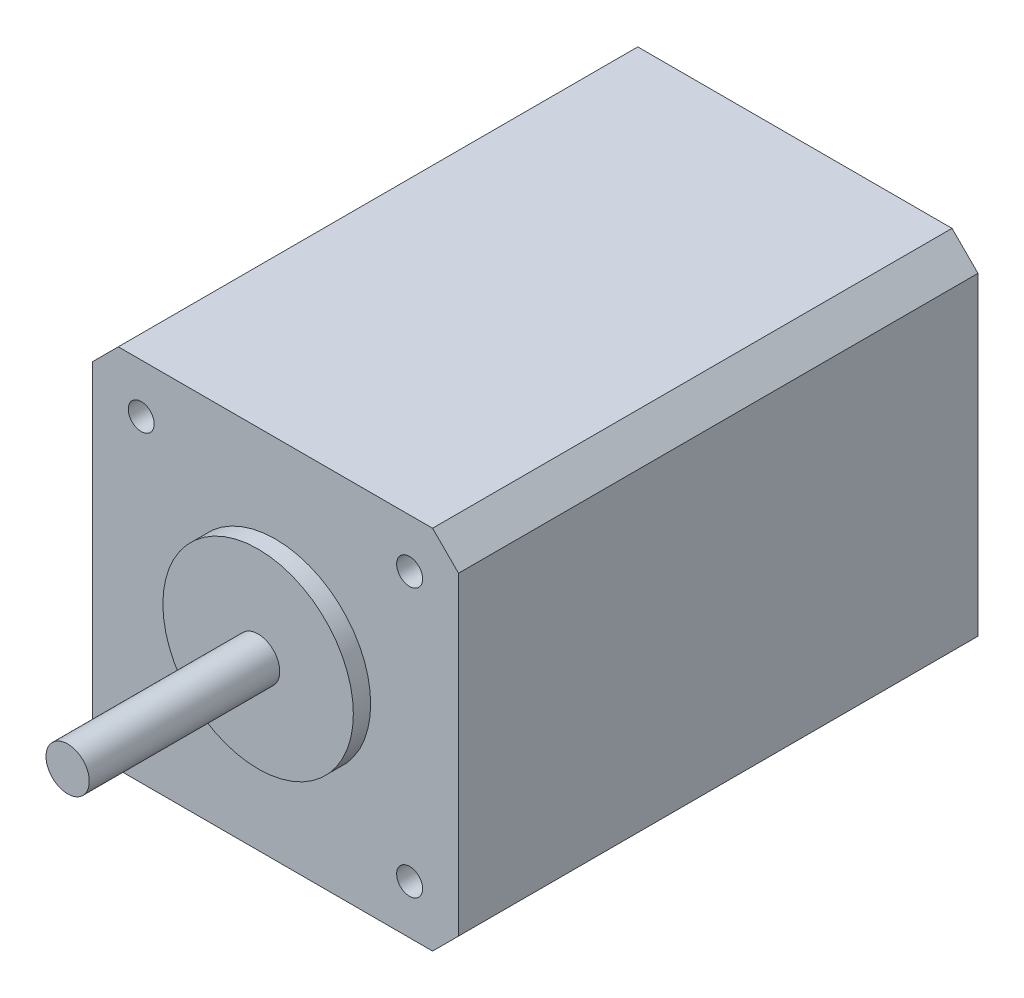
ISO-10303-21;
HEADER;
FILE_DESCRIPTION(('STEP AP214'),'2;1');
FILE_NAME('part.step','',(''),(''),'','','');
FILE_SCHEMA(('AUTOMOTIVE_DESIGN { 1 0 10303 214 1 1 1 1 }'));
ENDSEC;
DATA;
#1=APPLICATION_CONTEXT('core data for automotive mechanical design processes');
#2=APPLICATION_PROTOCOL_DEFINITION('international standard','automotive_design',2000,#1);
#3=PRODUCT_CONTEXT('',#1,'mechanical');
#4=PRODUCT('Part','Part','',(#3));
#5=PRODUCT_RELATED_PRODUCT_CATEGORY('part','',(#4));
#6=PRODUCT_DEFINITION_FORMATION('','',#4);
#7=PRODUCT_DEFINITION_CONTEXT('part definition',#1,'design');
#8=PRODUCT_DEFINITION('design','',#6,#7);
#9=PRODUCT_DEFINITION_SHAPE('','',#8);
#10=(LENGTH_UNIT() NAMED_UNIT(*) SI_UNIT(.MILLI.,.METRE.));
#11=(NAMED_UNIT(*) PLANE_ANGLE_UNIT() SI_UNIT($,.RADIAN.));
#12=(NAMED_UNIT(*) SI_UNIT($,.STERADIAN.) SOLID_ANGLE_UNIT());
#13=UNCERTAINTY_MEASURE_WITH_UNIT(LENGTH_MEASURE(1.E-05),#10,'distance_accuracy_value','');
#14=(GEOMETRIC_REPRESENTATION_CONTEXT(3) GLOBAL_UNCERTAINTY_ASSIGNED_CONTEXT((#13)) GLOBAL_UNIT_ASSIGNED_CONTEXT((#10,
#11,#12)) REPRESENTATION_CONTEXT('',''));
#15=CARTESIAN_POINT('',(0.,0.,0.));
#16=DIRECTION('',(0.,0.,1.));
#17=DIRECTION('',(1.,0.,0.));
#18=AXIS2_PLACEMENT_3D('',#15,#16,#17);
#19=CARTESIAN_POINT('',(21.15,21.15,-5.));
#20=DIRECTION('',(1.,0.,0.));
#21=DIRECTION('',(0.,1.,0.));
#22=AXIS2_PLACEMENT_3D('',#19,#20,#21);
#23=PLANE('',#22);
#24=DIRECTION('',(0.,-1.,0.));
#25=VECTOR('',#24,1.);
#26=CARTESIAN_POINT('',(21.15,21.15,-5.));
#27=LINE('',#26,#25);
#28=CARTESIAN_POINT('',(21.15,18.15,-5.));
#29=VERTEX_POINT('',#28);
#30=CARTESIAN_POINT('',(21.15,-18.15,-5.));
#31=VERTEX_POINT('',#30);
#32=EDGE_CURVE('E103',#29,#31,#27,.T.);
#33=ORIENTED_EDGE('',*,*,#32,.F.);
#34=DIRECTION('',(0.,0.,1.));
#35=VECTOR('',#34,1.);
#36=CARTESIAN_POINT('',(21.15,18.15,55.));
#37=LINE('',#36,#35);
#38=CARTESIAN_POINT('',(21.15,18.15,55.));
#39=VERTEX_POINT('',#38);
#40=EDGE_CURVE('E115',#29,#39,#37,.T.);
#41=ORIENTED_EDGE('',*,*,#40,.T.);
#42=DIRECTION('',(0.,-1.,0.));
#43=VECTOR('',#42,1.);
#44=CARTESIAN_POINT('',(21.15,21.15,55.));
#45=LINE('',#44,#43);
#46=CARTESIAN_POINT('',(21.15,-18.15,55.));
#47=VERTEX_POINT('',#46);
#48=EDGE_CURVE('E173',#39,#47,#45,.T.);
#49=ORIENTED_EDGE('',*,*,#48,.T.);
#50=DIRECTION('',(0.,0.,-1.));
#51=VECTOR('',#50,1.);
#52=CARTESIAN_POINT('',(21.15,-18.15,-5.));
#53=LINE('',#52,#51);
#54=EDGE_CURVE('E118',#47,#31,#53,.T.);
#55=ORIENTED_EDGE('',*,*,#54,.T.);
#56=EDGE_LOOP('',(#33,#41,#49,#55));
#57=FACE_BOUND('',#56,.T.);
#58=ADVANCED_FACE('F33',(#57),#23,.T.);
#59=CARTESIAN_POINT('',(-21.15,21.15,-5.));
#60=DIRECTION('',(0.,0.,-1.));
#61=DIRECTION('',(-1.,0.,0.));
#62=AXIS2_PLACEMENT_3D('',#59,#60,#61);
#63=PLANE('',#62);
#64=DIRECTION('',(1.,0.,0.));
#65=VECTOR('',#64,1.);
#66=CARTESIAN_POINT('',(-21.15,21.15,-5.));
#67=LINE('',#66,#65);
#68=CARTESIAN_POINT('',(-18.15,21.15,-5.));
#69=VERTEX_POINT('',#68);
#70=CARTESIAN_POINT('',(18.1499999999999,21.15,-5.));
#71=VERTEX_POINT('',#70);
#72=EDGE_CURVE('E106',#69,#71,#67,.T.);
#73=ORIENTED_EDGE('',*,*,#72,.T.);
#74=DIRECTION('',(0.707106781186549,-0.707106781186546,0.));
#75=VECTOR('',#74,1.);
#76=CARTESIAN_POINT('',(-1.50000000000011,40.8,-5.));
#77=LINE('',#76,#75);
#78=EDGE_CURVE('E100',#71,#29,#77,.T.);
#79=ORIENTED_EDGE('',*,*,#78,.T.);
#80=ORIENTED_EDGE('',*,*,#32,.T.);
#81=DIRECTION('',(0.707106781186545,0.70710678118655,0.));
#82=VECTOR('',#81,1.);
#83=CARTESIAN_POINT('',(19.6500000000001,-19.6499999999999,-5.));
#84=LINE('',#83,#82);
#85=CARTESIAN_POINT('',(18.15,-21.15,-5.));
#86=VERTEX_POINT('',#85);
#87=EDGE_CURVE('E139',#31,#86,#84,.F.);
#88=ORIENTED_EDGE('',*,*,#87,.T.);
#89=DIRECTION('',(1.,0.,0.));
#90=VECTOR('',#89,1.);
#91=CARTESIAN_POINT('',(-21.15,-21.15,-5.));
#92=LINE('',#91,#90);
#93=CARTESIAN_POINT('',(-18.15,-21.15,-5.));
#94=VERTEX_POINT('',#93);
#95=EDGE_CURVE('E154',#94,#86,#92,.T.);
#96=ORIENTED_EDGE('',*,*,#95,.F.);
#97=DIRECTION('',(0.707106781186546,-0.707106781186549,0.));
#98=VECTOR('',#97,1.);
#99=CARTESIAN_POINT('',(-40.8,1.50000000000009,-5.));
#100=LINE('',#99,#98);
#101=CARTESIAN_POINT('',(-21.15,-18.15,-5.));
#102=VERTEX_POINT('',#101);
#103=EDGE_CURVE('E48',#94,#102,#100,.F.);
#104=ORIENTED_EDGE('',*,*,#103,.T.);
#105=DIRECTION('',(0.,-1.,0.));
#106=VECTOR('',#105,1.);
#107=CARTESIAN_POINT('',(-21.15,21.15,-5.));
#108=LINE('',#107,#106);
#109=CARTESIAN_POINT('',(-21.15,18.15,-5.));
#110=VERTEX_POINT('',#109);
#111=EDGE_CURVE('E120',#110,#102,#108,.T.);
#112=ORIENTED_EDGE('',*,*,#111,.F.);
#113=DIRECTION('',(0.707106781186551,0.707106781186544,0.));
#114=VECTOR('',#113,1.);
#115=CARTESIAN_POINT('',(-19.65,19.65,-5.));
#116=LINE('',#115,#114);
#117=EDGE_CURVE('E56',#110,#69,#116,.T.);
#118=ORIENTED_EDGE('',*,*,#117,.T.);
#119=EDGE_LOOP('',(#73,#79,#80,#88,#96,#104,#112,#118));
#120=FACE_BOUND('',#119,.T.);
#121=ADVANCED_FACE('F102',(#120),#63,.T.);
#122=CARTESIAN_POINT('',(-21.15,21.15,55.));
#123=DIRECTION('',(-1.,0.,0.));
#124=DIRECTION('',(0.,-1.,0.));
#125=AXIS2_PLACEMENT_3D('',#122,#123,#124);
#126=PLANE('',#125);
#127=DIRECTION('',(0.,-1.,0.));
#128=VECTOR('',#127,1.);
#129=CARTESIAN_POINT('',(-21.15,21.15,55.));
#130=LINE('',#129,#128);
#131=CARTESIAN_POINT('',(-21.15,18.15,55.));
#132=VERTEX_POINT('',#131);
#133=CARTESIAN_POINT('',(-21.15,-18.15,55.));
#134=VERTEX_POINT('',#133);
#135=EDGE_CURVE('E171',#132,#134,#130,.T.);
#136=ORIENTED_EDGE('',*,*,#135,.F.);
#137=DIRECTION('',(0.,0.,-1.));
#138=VECTOR('',#137,1.);
#139=CARTESIAN_POINT('',(-21.15,18.15,-5.));
#140=LINE('',#139,#138);
#141=EDGE_CURVE('E144',#132,#110,#140,.T.);
#142=ORIENTED_EDGE('',*,*,#141,.T.);
#143=ORIENTED_EDGE('',*,*,#111,.T.);
#144=DIRECTION('',(0.,0.,1.));
#145=VECTOR('',#144,1.);
#146=CARTESIAN_POINT('',(-21.15,-18.15,55.));
#147=LINE('',#146,#145);
#148=EDGE_CURVE('E110',#102,#134,#147,.T.);
#149=ORIENTED_EDGE('',*,*,#148,.T.);
#150=EDGE_LOOP('',(#136,#142,#143,#149));
#151=FACE_BOUND('',#150,.T.);
#152=ADVANCED_FACE('F181',(#151),#126,.T.);
#153=CARTESIAN_POINT('',(21.15,21.15,55.));
#154=DIRECTION('',(0.,0.,1.));
#155=DIRECTION('',(1.,0.,0.));
#156=AXIS2_PLACEMENT_3D('',#153,#154,#155);
#157=PLANE('',#156);
#158=CARTESIAN_POINT('',(15.5,-15.5,55.));
#159=DIRECTION('',(0.,0.,1.));
#160=DIRECTION('',(1.,0.,0.));
#161=AXIS2_PLACEMENT_3D('',#158,#159,#160);
#162=CIRCLE('',#161,1.49999999999999);
#163=CARTESIAN_POINT('',(17.,-15.5,55.));
#164=VERTEX_POINT('',#163);
#165=EDGE_CURVE('E244',#164,#164,#162,.T.);
#166=ORIENTED_EDGE('',*,*,#165,.F.);
#167=EDGE_LOOP('',(#166));
#168=FACE_BOUND('',#167,.T.);
#169=CARTESIAN_POINT('',(-15.5,-15.5,55.));
#170=DIRECTION('',(0.,0.,1.));
#171=DIRECTION('',(1.,0.,0.));
#172=AXIS2_PLACEMENT_3D('',#169,#170,#171);
#173=CIRCLE('',#172,1.49999999999999);
#174=CARTESIAN_POINT('',(-14.,-15.5,55.));
#175=VERTEX_POINT('',#174);
#176=EDGE_CURVE('E238',#175,#175,#173,.T.);
#177=ORIENTED_EDGE('',*,*,#176,.F.);
#178=EDGE_LOOP('',(#177));
#179=FACE_BOUND('',#178,.T.);
#180=CARTESIAN_POINT('',(-15.5,15.5,55.));
#181=DIRECTION('',(0.,0.,1.));
#182=DIRECTION('',(1.,0.,0.));
#183=AXIS2_PLACEMENT_3D('',#180,#181,#182);
#184=CIRCLE('',#183,1.49999999999999);
#185=CARTESIAN_POINT('',(-14.,15.5,55.));
#186=VERTEX_POINT('',#185);
#187=EDGE_CURVE('E232',#186,#186,#184,.T.);
#188=ORIENTED_EDGE('',*,*,#187,.F.);
#189=EDGE_LOOP('',(#188));
#190=FACE_BOUND('',#189,.T.);
#191=CARTESIAN_POINT('',(15.5,15.5,55.));
#192=DIRECTION('',(0.,0.,1.));
#193=DIRECTION('',(1.,0.,0.));
#194=AXIS2_PLACEMENT_3D('',#191,#192,#193);
#195=CIRCLE('',#194,1.49999999999999);
#196=CARTESIAN_POINT('',(17.,15.5,55.));
#197=VERTEX_POINT('',#196);
#198=EDGE_CURVE('E226',#197,#197,#195,.T.);
#199=ORIENTED_EDGE('',*,*,#198,.F.);
#200=EDGE_LOOP('',(#199));
#201=FACE_BOUND('',#200,.T.);
#202=CARTESIAN_POINT('',(0.,0.,55.));
#203=DIRECTION('',(0.,0.,1.));
#204=DIRECTION('',(1.,0.,0.));
#205=AXIS2_PLACEMENT_3D('',#202,#203,#204);
#206=CIRCLE('',#205,11.);
#207=CARTESIAN_POINT('',(11.,0.,55.));
#208=VERTEX_POINT('',#207);
#209=EDGE_CURVE('E119',#208,#208,#206,.T.);
#210=ORIENTED_EDGE('',*,*,#209,.F.);
#211=EDGE_LOOP('',(#210));
#212=FACE_BOUND('',#211,.T.);
#213=ORIENTED_EDGE('',*,*,#48,.F.);
#214=DIRECTION('',(-0.707106781186549,0.707106781186546,0.));
#215=VECTOR('',#214,1.);
#216=CARTESIAN_POINT('',(19.65,19.65,55.));
#217=LINE('',#216,#215);
#218=CARTESIAN_POINT('',(18.15,21.15,55.));
#219=VERTEX_POINT('',#218);
#220=EDGE_CURVE('E123',#39,#219,#217,.T.);
#221=ORIENTED_EDGE('',*,*,#220,.T.);
#222=DIRECTION('',(-1.,0.,0.));
#223=VECTOR('',#222,1.);
#224=CARTESIAN_POINT('',(21.15,21.15,55.));
#225=LINE('',#224,#223);
#226=CARTESIAN_POINT('',(-18.15,21.15,55.));
#227=VERTEX_POINT('',#226);
#228=EDGE_CURVE('E162',#219,#227,#225,.T.);
#229=ORIENTED_EDGE('',*,*,#228,.T.);
#230=DIRECTION('',(-0.707106781186551,-0.707106781186544,0.));
#231=VECTOR('',#230,1.);
#232=CARTESIAN_POINT('',(1.50000000000019,40.8,55.));
#233=LINE('',#232,#231);
#234=EDGE_CURVE('E132',#227,#132,#233,.T.);
#235=ORIENTED_EDGE('',*,*,#234,.T.);
#236=ORIENTED_EDGE('',*,*,#135,.T.);
#237=DIRECTION('',(-0.707106781186546,0.707106781186549,0.));
#238=VECTOR('',#237,1.);
#239=CARTESIAN_POINT('',(-19.6500000000001,-19.6499999999999,55.));
#240=LINE('',#239,#238);
#241=CARTESIAN_POINT('',(-18.15,-21.15,55.));
#242=VERTEX_POINT('',#241);
#243=EDGE_CURVE('E126',#134,#242,#240,.F.);
#244=ORIENTED_EDGE('',*,*,#243,.T.);
#245=DIRECTION('',(-1.,0.,0.));
#246=VECTOR('',#245,1.);
#247=CARTESIAN_POINT('',(21.15,-21.15,55.));
#248=LINE('',#247,#246);
#249=CARTESIAN_POINT('',(18.15,-21.15,55.));
#250=VERTEX_POINT('',#249);
#251=EDGE_CURVE('E152',#250,#242,#248,.T.);
#252=ORIENTED_EDGE('',*,*,#251,.F.);
#253=DIRECTION('',(-0.707106781186545,-0.70710678118655,0.));
#254=VECTOR('',#253,1.);
#255=CARTESIAN_POINT('',(40.8,1.50000000000014,55.));
#256=LINE('',#255,#254);
#257=EDGE_CURVE('E124',#250,#47,#256,.F.);
#258=ORIENTED_EDGE('',*,*,#257,.T.);
#259=EDGE_LOOP('',(#213,#221,#229,#235,#236,#244,#252,#258));
#260=FACE_BOUND('',#259,.T.);
#261=ADVANCED_FACE('F157',(#168,#179,#190,#201,#212,#260),#157,.T.);
#262=CARTESIAN_POINT('',(0.,21.15,0.));
#263=DIRECTION('',(0.,-1.,0.));
#264=DIRECTION('',(1.,0.,0.));
#265=AXIS2_PLACEMENT_3D('',#262,#263,#264);
#266=PLANE('',#265);
#267=ORIENTED_EDGE('',*,*,#228,.F.);
#268=DIRECTION('',(0.,0.,-1.));
#269=VECTOR('',#268,1.);
#270=CARTESIAN_POINT('',(18.15,21.15,-5.));
#271=LINE('',#270,#269);
#272=EDGE_CURVE('E137',#219,#71,#271,.T.);
#273=ORIENTED_EDGE('',*,*,#272,.T.);
#274=ORIENTED_EDGE('',*,*,#72,.F.);
#275=DIRECTION('',(0.,0.,1.));
#276=VECTOR('',#275,1.);
#277=CARTESIAN_POINT('',(-18.15,21.15,55.));
#278=LINE('',#277,#276);
#279=EDGE_CURVE('E135',#69,#227,#278,.T.);
#280=ORIENTED_EDGE('',*,*,#279,.T.);
#281=EDGE_LOOP('',(#267,#273,#274,#280));
#282=FACE_BOUND('',#281,.T.);
#283=ADVANCED_FACE('F180',(#282),#266,.F.);
#284=CARTESIAN_POINT('',(0.,-21.15,0.));
#285=DIRECTION('',(0.,-1.,0.));
#286=DIRECTION('',(1.,0.,0.));
#287=AXIS2_PLACEMENT_3D('',#284,#285,#286);
#288=PLANE('',#287);
#289=ORIENTED_EDGE('',*,*,#251,.T.);
#290=DIRECTION('',(0.,0.,-1.));
#291=VECTOR('',#290,1.);
#292=CARTESIAN_POINT('',(-18.15,-21.15,0.));
#293=LINE('',#292,#291);
#294=EDGE_CURVE('E11',#242,#94,#293,.T.);
#295=ORIENTED_EDGE('',*,*,#294,.T.);
#296=ORIENTED_EDGE('',*,*,#95,.T.);
#297=DIRECTION('',(0.,0.,1.));
#298=VECTOR('',#297,1.);
#299=CARTESIAN_POINT('',(18.15,-21.15,0.));
#300=LINE('',#299,#298);
#301=EDGE_CURVE('E41',#86,#250,#300,.T.);
#302=ORIENTED_EDGE('',*,*,#301,.T.);
#303=EDGE_LOOP('',(#289,#295,#296,#302));
#304=FACE_BOUND('',#303,.T.);
#305=ADVANCED_FACE('F151',(#304),#288,.T.);
#306=CARTESIAN_POINT('',(0.,0.,79.));
#307=DIRECTION('',(0.,0.,-1.));
#308=DIRECTION('',(-1.,0.,0.));
#309=AXIS2_PLACEMENT_3D('',#306,#307,#308);
#310=CYLINDRICAL_SURFACE('',#309,2.5);
#311=CARTESIAN_POINT('',(0.,0.,79.));
#312=DIRECTION('',(0.,0.,-1.));
#313=DIRECTION('',(-1.,0.,0.));
#314=AXIS2_PLACEMENT_3D('',#311,#312,#313);
#315=CIRCLE('',#314,2.5);
#316=CARTESIAN_POINT('',(-2.5,0.,79.));
#317=VERTEX_POINT('',#316);
#318=EDGE_CURVE('E160',#317,#317,#315,.T.);
#319=ORIENTED_EDGE('',*,*,#318,.T.);
#320=EDGE_LOOP('',(#319));
#321=FACE_BOUND('',#320,.T.);
#322=CARTESIAN_POINT('',(0.,0.,57.));
#323=DIRECTION('',(0.,0.,-1.));
#324=DIRECTION('',(-1.,0.,0.));
#325=AXIS2_PLACEMENT_3D('',#322,#323,#324);
#326=CIRCLE('',#325,2.5);
#327=CARTESIAN_POINT('',(-2.5,0.,57.));
#328=VERTEX_POINT('',#327);
#329=EDGE_CURVE('E220',#328,#328,#326,.T.);
#330=ORIENTED_EDGE('',*,*,#329,.F.);
#331=EDGE_LOOP('',(#330));
#332=FACE_BOUND('',#331,.T.);
#333=ADVANCED_FACE('F292',(#321,#332),#310,.T.);
#334=CARTESIAN_POINT('',(2.5,0.,79.));
#335=DIRECTION('',(0.,0.,1.));
#336=DIRECTION('',(1.,0.,0.));
#337=AXIS2_PLACEMENT_3D('',#334,#335,#336);
#338=PLANE('',#337);
#339=ORIENTED_EDGE('',*,*,#318,.F.);
#340=EDGE_LOOP('',(#339));
#341=FACE_BOUND('',#340,.T.);
#342=ADVANCED_FACE('F288',(#341),#338,.T.);
#343=CARTESIAN_POINT('',(0.,0.,79.));
#344=DIRECTION('',(0.,0.,-1.));
#345=DIRECTION('',(-1.,0.,0.));
#346=AXIS2_PLACEMENT_3D('',#343,#344,#345);
#347=CYLINDRICAL_SURFACE('',#346,11.);
#348=CARTESIAN_POINT('',(0.,0.,57.));
#349=DIRECTION('',(0.,0.,-1.));
#350=DIRECTION('',(-1.,0.,0.));
#351=AXIS2_PLACEMENT_3D('',#348,#349,#350);
#352=CIRCLE('',#351,11.);
#353=CARTESIAN_POINT('',(-11.,0.,57.));
#354=VERTEX_POINT('',#353);
#355=EDGE_CURVE('E165',#354,#354,#352,.T.);
#356=ORIENTED_EDGE('',*,*,#355,.T.);
#357=EDGE_LOOP('',(#356));
#358=FACE_BOUND('',#357,.T.);
#359=ORIENTED_EDGE('',*,*,#209,.T.);
#360=EDGE_LOOP('',(#359));
#361=FACE_BOUND('',#360,.T.);
#362=ADVANCED_FACE('F177',(#358,#361),#347,.T.);
#363=CARTESIAN_POINT('',(11.,0.,57.));
#364=DIRECTION('',(0.,0.,1.));
#365=DIRECTION('',(1.,0.,0.));
#366=AXIS2_PLACEMENT_3D('',#363,#364,#365);
#367=PLANE('',#366);
#368=ORIENTED_EDGE('',*,*,#329,.T.);
#369=EDGE_LOOP('',(#368));
#370=FACE_BOUND('',#369,.T.);
#371=ORIENTED_EDGE('',*,*,#355,.F.);
#372=EDGE_LOOP('',(#371));
#373=FACE_BOUND('',#372,.T.);
#374=ADVANCED_FACE('F281',(#370,#373),#367,.T.);
#375=CARTESIAN_POINT('',(15.5,15.5,50.));
#376=DIRECTION('',(0.,0.,-1.));
#377=DIRECTION('',(-1.,0.,0.));
#378=AXIS2_PLACEMENT_3D('',#375,#376,#377);
#379=PLANE('',#378);
#380=CARTESIAN_POINT('',(15.5,15.5,50.));
#381=DIRECTION('',(0.,0.,1.));
#382=DIRECTION('',(1.,0.,0.));
#383=AXIS2_PLACEMENT_3D('',#380,#381,#382);
#384=CIRCLE('',#383,1.49999999999999);
#385=CARTESIAN_POINT('',(17.,15.5,50.));
#386=VERTEX_POINT('',#385);
#387=EDGE_CURVE('E223',#386,#386,#384,.T.);
#388=ORIENTED_EDGE('',*,*,#387,.T.);
#389=EDGE_LOOP('',(#388));
#390=FACE_BOUND('',#389,.T.);
#391=ADVANCED_FACE('F277',(#390),#379,.F.);
#392=CARTESIAN_POINT('',(15.5,15.5,55.));
#393=DIRECTION('',(0.,0.,1.));
#394=DIRECTION('',(1.,0.,0.));
#395=AXIS2_PLACEMENT_3D('',#392,#393,#394);
#396=CYLINDRICAL_SURFACE('',#395,1.49999999999999);
#397=ORIENTED_EDGE('',*,*,#387,.F.);
#398=EDGE_LOOP('',(#397));
#399=FACE_BOUND('',#398,.T.);
#400=ORIENTED_EDGE('',*,*,#198,.T.);
#401=EDGE_LOOP('',(#400));
#402=FACE_BOUND('',#401,.T.);
#403=ADVANCED_FACE('F273',(#399,#402),#396,.F.);
#404=CARTESIAN_POINT('',(-15.5,15.5,50.));
#405=DIRECTION('',(0.,0.,-1.));
#406=DIRECTION('',(-1.,0.,0.));
#407=AXIS2_PLACEMENT_3D('',#404,#405,#406);
#408=PLANE('',#407);
#409=CARTESIAN_POINT('',(-15.5,15.5,50.));
#410=DIRECTION('',(0.,0.,1.));
#411=DIRECTION('',(1.,0.,0.));
#412=AXIS2_PLACEMENT_3D('',#409,#410,#411);
#413=CIRCLE('',#412,1.49999999999999);
#414=CARTESIAN_POINT('',(-14.,15.5,50.));
#415=VERTEX_POINT('',#414);
#416=EDGE_CURVE('E229',#415,#415,#413,.T.);
#417=ORIENTED_EDGE('',*,*,#416,.T.);
#418=EDGE_LOOP('',(#417));
#419=FACE_BOUND('',#418,.T.);
#420=ADVANCED_FACE('F269',(#419),#408,.F.);
#421=CARTESIAN_POINT('',(-15.5,15.5,55.));
#422=DIRECTION('',(0.,0.,1.));
#423=DIRECTION('',(1.,0.,0.));
#424=AXIS2_PLACEMENT_3D('',#421,#422,#423);
#425=CYLINDRICAL_SURFACE('',#424,1.49999999999999);
#426=ORIENTED_EDGE('',*,*,#416,.F.);
#427=EDGE_LOOP('',(#426));
#428=FACE_BOUND('',#427,.T.);
#429=ORIENTED_EDGE('',*,*,#187,.T.);
#430=EDGE_LOOP('',(#429));
#431=FACE_BOUND('',#430,.T.);
#432=ADVANCED_FACE('F265',(#428,#431),#425,.F.);
#433=CARTESIAN_POINT('',(-15.5,-15.5,50.));
#434=DIRECTION('',(0.,0.,-1.));
#435=DIRECTION('',(-1.,0.,0.));
#436=AXIS2_PLACEMENT_3D('',#433,#434,#435);
#437=PLANE('',#436);
#438=CARTESIAN_POINT('',(-15.5,-15.5,50.));
#439=DIRECTION('',(0.,0.,1.));
#440=DIRECTION('',(1.,0.,0.));
#441=AXIS2_PLACEMENT_3D('',#438,#439,#440);
#442=CIRCLE('',#441,1.49999999999999);
#443=CARTESIAN_POINT('',(-14.,-15.5,50.));
#444=VERTEX_POINT('',#443);
#445=EDGE_CURVE('E235',#444,#444,#442,.T.);
#446=ORIENTED_EDGE('',*,*,#445,.T.);
#447=EDGE_LOOP('',(#446));
#448=FACE_BOUND('',#447,.T.);
#449=ADVANCED_FACE('F261',(#448),#437,.F.);
#450=CARTESIAN_POINT('',(-15.5,-15.5,55.));
#451=DIRECTION('',(0.,0.,1.));
#452=DIRECTION('',(1.,0.,0.));
#453=AXIS2_PLACEMENT_3D('',#450,#451,#452);
#454=CYLINDRICAL_SURFACE('',#453,1.49999999999999);
#455=ORIENTED_EDGE('',*,*,#445,.F.);
#456=EDGE_LOOP('',(#455));
#457=FACE_BOUND('',#456,.T.);
#458=ORIENTED_EDGE('',*,*,#176,.T.);
#459=EDGE_LOOP('',(#458));
#460=FACE_BOUND('',#459,.T.);
#461=ADVANCED_FACE('F254',(#457,#460),#454,.F.);
#462=CARTESIAN_POINT('',(15.5,-15.5,50.));
#463=DIRECTION('',(0.,0.,-1.));
#464=DIRECTION('',(-1.,0.,0.));
#465=AXIS2_PLACEMENT_3D('',#462,#463,#464);
#466=PLANE('',#465);
#467=CARTESIAN_POINT('',(15.5,-15.5,50.));
#468=DIRECTION('',(0.,0.,1.));
#469=DIRECTION('',(1.,0.,0.));
#470=AXIS2_PLACEMENT_3D('',#467,#468,#469);
#471=CIRCLE('',#470,1.49999999999999);
#472=CARTESIAN_POINT('',(17.,-15.5,50.));
#473=VERTEX_POINT('',#472);
#474=EDGE_CURVE('E241',#473,#473,#471,.T.);
#475=ORIENTED_EDGE('',*,*,#474,.T.);
#476=EDGE_LOOP('',(#475));
#477=FACE_BOUND('',#476,.T.);
#478=ADVANCED_FACE('F248',(#477),#466,.F.);
#479=CARTESIAN_POINT('',(15.5,-15.5,55.));
#480=DIRECTION('',(0.,0.,1.));
#481=DIRECTION('',(1.,0.,0.));
#482=AXIS2_PLACEMENT_3D('',#479,#480,#481);
#483=CYLINDRICAL_SURFACE('',#482,1.49999999999999);
#484=ORIENTED_EDGE('',*,*,#474,.F.);
#485=EDGE_LOOP('',(#484));
#486=FACE_BOUND('',#485,.T.);
#487=ORIENTED_EDGE('',*,*,#165,.T.);
#488=EDGE_LOOP('',(#487));
#489=FACE_BOUND('',#488,.T.);
#490=ADVANCED_FACE('F204',(#486,#489),#483,.F.);
#491=CARTESIAN_POINT('',(21.15,18.15,-5.));
#492=DIRECTION('',(0.707106781186546,0.707106781186549,0.));
#493=DIRECTION('',(0.,0.,-1.));
#494=AXIS2_PLACEMENT_3D('',#491,#492,#493);
#495=PLANE('',#494);
#496=ORIENTED_EDGE('',*,*,#78,.F.);
#497=ORIENTED_EDGE('',*,*,#272,.F.);
#498=ORIENTED_EDGE('',*,*,#220,.F.);
#499=ORIENTED_EDGE('',*,*,#40,.F.);
#500=EDGE_LOOP('',(#496,#497,#498,#499));
#501=FACE_BOUND('',#500,.T.);
#502=ADVANCED_FACE('F122',(#501),#495,.T.);
#503=CARTESIAN_POINT('',(-21.15,18.15,55.));
#504=DIRECTION('',(-0.707106781186544,0.707106781186551,0.));
#505=DIRECTION('',(0.,0.,1.));
#506=AXIS2_PLACEMENT_3D('',#503,#504,#505);
#507=PLANE('',#506);
#508=ORIENTED_EDGE('',*,*,#234,.F.);
#509=ORIENTED_EDGE('',*,*,#279,.F.);
#510=ORIENTED_EDGE('',*,*,#117,.F.);
#511=ORIENTED_EDGE('',*,*,#141,.F.);
#512=EDGE_LOOP('',(#508,#509,#510,#511));
#513=FACE_BOUND('',#512,.T.);
#514=ADVANCED_FACE('F203',(#513),#507,.T.);
#515=CARTESIAN_POINT('',(-18.15,-21.15,0.));
#516=DIRECTION('',(0.707106781186549,0.707106781186546,0.));
#517=DIRECTION('',(0.,0.,-1.));
#518=AXIS2_PLACEMENT_3D('',#515,#516,#517);
#519=PLANE('',#518);
#520=ORIENTED_EDGE('',*,*,#243,.F.);
#521=ORIENTED_EDGE('',*,*,#148,.F.);
#522=ORIENTED_EDGE('',*,*,#103,.F.);
#523=ORIENTED_EDGE('',*,*,#294,.F.);
#524=EDGE_LOOP('',(#520,#521,#522,#523));
#525=FACE_BOUND('',#524,.T.);
#526=ADVANCED_FACE('F206',(#525),#519,.F.);
#527=CARTESIAN_POINT('',(18.15,-21.15,0.));
#528=DIRECTION('',(-0.70710678118655,0.707106781186545,0.));
#529=DIRECTION('',(0.,0.,1.));
#530=AXIS2_PLACEMENT_3D('',#527,#528,#529);
#531=PLANE('',#530);
#532=ORIENTED_EDGE('',*,*,#87,.F.);
#533=ORIENTED_EDGE('',*,*,#54,.F.);
#534=ORIENTED_EDGE('',*,*,#257,.F.);
#535=ORIENTED_EDGE('',*,*,#301,.F.);
#536=EDGE_LOOP('',(#532,#533,#534,#535));
#537=FACE_BOUND('',#536,.T.);
#538=ADVANCED_FACE('F35',(#537),#531,.F.);
#539=CLOSED_SHELL('',(#58,#121,#152,#261,#283,#305,#333,#342,#362,#374,#391,#403,#420,#432,#449,
#461,#478,#490,#502,#514,#526,#538));
#540=MANIFOLD_SOLID_BREP('B2',#539);
#541=ADVANCED_BREP_SHAPE_REPRESENTATION('',(#18,#540),#14);
#542=SHAPE_DEFINITION_REPRESENTATION(#9,#541);
ENDSEC;
END-ISO-10303-21;
